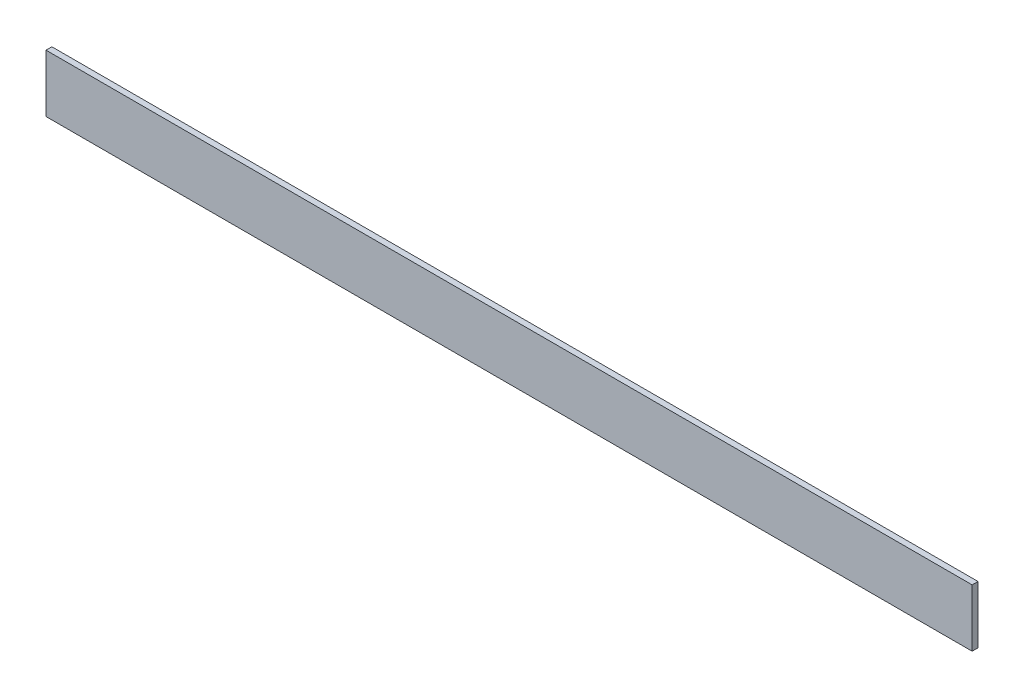
ISO-10303-21;
HEADER;
FILE_DESCRIPTION(('STEP AP214'),'2;1');
FILE_NAME('part.step','',(''),(''),'','','');
FILE_SCHEMA(('AUTOMOTIVE_DESIGN { 1 0 10303 214 1 1 1 1 }'));
ENDSEC;
DATA;
#1=APPLICATION_CONTEXT('core data for automotive mechanical design processes');
#2=APPLICATION_PROTOCOL_DEFINITION('international standard','automotive_design',2000,#1);
#3=PRODUCT_CONTEXT('',#1,'mechanical');
#4=PRODUCT('Part','Part','',(#3));
#5=PRODUCT_RELATED_PRODUCT_CATEGORY('part','',(#4));
#6=PRODUCT_DEFINITION_FORMATION('','',#4);
#7=PRODUCT_DEFINITION_CONTEXT('part definition',#1,'design');
#8=PRODUCT_DEFINITION('design','',#6,#7);
#9=PRODUCT_DEFINITION_SHAPE('','',#8);
#10=(LENGTH_UNIT() NAMED_UNIT(*) SI_UNIT(.MILLI.,.METRE.));
#11=(NAMED_UNIT(*) PLANE_ANGLE_UNIT() SI_UNIT($,.RADIAN.));
#12=(NAMED_UNIT(*) SI_UNIT($,.STERADIAN.) SOLID_ANGLE_UNIT());
#13=UNCERTAINTY_MEASURE_WITH_UNIT(LENGTH_MEASURE(1.E-05),#10,'distance_accuracy_value','');
#14=(GEOMETRIC_REPRESENTATION_CONTEXT(3) GLOBAL_UNCERTAINTY_ASSIGNED_CONTEXT((#13)) GLOBAL_UNIT_ASSIGNED_CONTEXT((#10,
#11,#12)) REPRESENTATION_CONTEXT('',''));
#15=CARTESIAN_POINT('',(0.,0.,0.));
#16=DIRECTION('',(0.,0.,1.));
#17=DIRECTION('',(1.,0.,0.));
#18=AXIS2_PLACEMENT_3D('',#15,#16,#17);
#19=CARTESIAN_POINT('',(236.665,14.69,3.));
#20=DIRECTION('',(-1.,0.,0.));
#21=DIRECTION('',(0.,0.,1.));
#22=AXIS2_PLACEMENT_3D('',#19,#20,#21);
#23=PLANE('',#22);
#24=DIRECTION('',(0.,1.,0.));
#25=VECTOR('',#24,1.);
#26=CARTESIAN_POINT('',(236.665,14.69,0.));
#27=LINE('',#26,#25);
#28=CARTESIAN_POINT('',(236.665,-14.69,0.));
#29=VERTEX_POINT('',#28);
#30=CARTESIAN_POINT('',(236.665,14.69,0.));
#31=VERTEX_POINT('',#30);
#32=EDGE_CURVE('E102',#29,#31,#27,.T.);
#33=ORIENTED_EDGE('',*,*,#32,.T.);
#34=DIRECTION('',(0.,0.,-1.));
#35=VECTOR('',#34,1.);
#36=CARTESIAN_POINT('',(236.665,14.69,3.));
#37=LINE('',#36,#35);
#38=CARTESIAN_POINT('',(236.665,14.69,3.));
#39=VERTEX_POINT('',#38);
#40=EDGE_CURVE('E11',#39,#31,#37,.T.);
#41=ORIENTED_EDGE('',*,*,#40,.F.);
#42=DIRECTION('',(0.,1.,0.));
#43=VECTOR('',#42,1.);
#44=CARTESIAN_POINT('',(236.665,14.69,3.));
#45=LINE('',#44,#43);
#46=CARTESIAN_POINT('',(236.665,-14.69,3.));
#47=VERTEX_POINT('',#46);
#48=EDGE_CURVE('E90',#47,#39,#45,.T.);
#49=ORIENTED_EDGE('',*,*,#48,.F.);
#50=DIRECTION('',(0.,0.,-1.));
#51=VECTOR('',#50,1.);
#52=CARTESIAN_POINT('',(236.665,-14.69,3.));
#53=LINE('',#52,#51);
#54=EDGE_CURVE('E98',#47,#29,#53,.T.);
#55=ORIENTED_EDGE('',*,*,#54,.T.);
#56=EDGE_LOOP('',(#33,#41,#49,#55));
#57=FACE_BOUND('',#56,.T.);
#58=ADVANCED_FACE('F39',(#57),#23,.F.);
#59=CARTESIAN_POINT('',(-236.665,14.69,3.));
#60=DIRECTION('',(0.,-1.,0.));
#61=DIRECTION('',(0.,0.,-1.));
#62=AXIS2_PLACEMENT_3D('',#59,#60,#61);
#63=PLANE('',#62);
#64=DIRECTION('',(-1.,0.,0.));
#65=VECTOR('',#64,1.);
#66=CARTESIAN_POINT('',(-236.665,14.69,0.));
#67=LINE('',#66,#65);
#68=CARTESIAN_POINT('',(-236.665,14.69,0.));
#69=VERTEX_POINT('',#68);
#70=EDGE_CURVE('E94',#31,#69,#67,.T.);
#71=ORIENTED_EDGE('',*,*,#70,.T.);
#72=DIRECTION('',(0.,0.,-1.));
#73=VECTOR('',#72,1.);
#74=CARTESIAN_POINT('',(-236.665,14.69,3.));
#75=LINE('',#74,#73);
#76=CARTESIAN_POINT('',(-236.665,14.69,3.));
#77=VERTEX_POINT('',#76);
#78=EDGE_CURVE('E47',#77,#69,#75,.T.);
#79=ORIENTED_EDGE('',*,*,#78,.F.);
#80=DIRECTION('',(-1.,0.,0.));
#81=VECTOR('',#80,1.);
#82=CARTESIAN_POINT('',(-236.665,14.69,3.));
#83=LINE('',#82,#81);
#84=EDGE_CURVE('E85',#39,#77,#83,.T.);
#85=ORIENTED_EDGE('',*,*,#84,.F.);
#86=ORIENTED_EDGE('',*,*,#40,.T.);
#87=EDGE_LOOP('',(#71,#79,#85,#86));
#88=FACE_BOUND('',#87,.T.);
#89=ADVANCED_FACE('F93',(#88),#63,.F.);
#90=CARTESIAN_POINT('',(-236.665,14.69,3.));
#91=DIRECTION('',(1.,0.,0.));
#92=DIRECTION('',(0.,0.,-1.));
#93=AXIS2_PLACEMENT_3D('',#90,#91,#92);
#94=PLANE('',#93);
#95=DIRECTION('',(0.,-1.,0.));
#96=VECTOR('',#95,1.);
#97=CARTESIAN_POINT('',(-236.665,14.69,0.));
#98=LINE('',#97,#96);
#99=CARTESIAN_POINT('',(-236.665,-14.69,0.));
#100=VERTEX_POINT('',#99);
#101=EDGE_CURVE('E72',#69,#100,#98,.T.);
#102=ORIENTED_EDGE('',*,*,#101,.T.);
#103=DIRECTION('',(0.,0.,-1.));
#104=VECTOR('',#103,1.);
#105=CARTESIAN_POINT('',(-236.665,-14.69,3.));
#106=LINE('',#105,#104);
#107=CARTESIAN_POINT('',(-236.665,-14.69,3.));
#108=VERTEX_POINT('',#107);
#109=EDGE_CURVE('E95',#108,#100,#106,.T.);
#110=ORIENTED_EDGE('',*,*,#109,.F.);
#111=DIRECTION('',(0.,-1.,0.));
#112=VECTOR('',#111,1.);
#113=CARTESIAN_POINT('',(-236.665,14.69,3.));
#114=LINE('',#113,#112);
#115=EDGE_CURVE('E88',#77,#108,#114,.T.);
#116=ORIENTED_EDGE('',*,*,#115,.F.);
#117=ORIENTED_EDGE('',*,*,#78,.T.);
#118=EDGE_LOOP('',(#102,#110,#116,#117));
#119=FACE_BOUND('',#118,.T.);
#120=ADVANCED_FACE('F96',(#119),#94,.F.);
#121=CARTESIAN_POINT('',(-236.665,-14.69,3.));
#122=DIRECTION('',(0.,1.,0.));
#123=DIRECTION('',(0.,0.,1.));
#124=AXIS2_PLACEMENT_3D('',#121,#122,#123);
#125=PLANE('',#124);
#126=DIRECTION('',(1.,0.,0.));
#127=VECTOR('',#126,1.);
#128=CARTESIAN_POINT('',(-236.665,-14.69,0.));
#129=LINE('',#128,#127);
#130=EDGE_CURVE('E78',#100,#29,#129,.T.);
#131=ORIENTED_EDGE('',*,*,#130,.T.);
#132=ORIENTED_EDGE('',*,*,#54,.F.);
#133=DIRECTION('',(1.,0.,0.));
#134=VECTOR('',#133,1.);
#135=CARTESIAN_POINT('',(-236.665,-14.69,3.));
#136=LINE('',#135,#134);
#137=EDGE_CURVE('E55',#108,#47,#136,.T.);
#138=ORIENTED_EDGE('',*,*,#137,.F.);
#139=ORIENTED_EDGE('',*,*,#109,.T.);
#140=EDGE_LOOP('',(#131,#132,#138,#139));
#141=FACE_BOUND('',#140,.T.);
#142=ADVANCED_FACE('F109',(#141),#125,.F.);
#143=CARTESIAN_POINT('',(0.,0.,3.));
#144=DIRECTION('',(0.,0.,1.));
#145=DIRECTION('',(1.,0.,0.));
#146=AXIS2_PLACEMENT_3D('',#143,#144,#145);
#147=PLANE('',#146);
#148=ORIENTED_EDGE('',*,*,#48,.T.);
#149=ORIENTED_EDGE('',*,*,#84,.T.);
#150=ORIENTED_EDGE('',*,*,#115,.T.);
#151=ORIENTED_EDGE('',*,*,#137,.T.);
#152=EDGE_LOOP('',(#148,#149,#150,#151));
#153=FACE_BOUND('',#152,.T.);
#154=ADVANCED_FACE('F86',(#153),#147,.T.);
#155=CARTESIAN_POINT('',(0.,0.,0.));
#156=DIRECTION('',(0.,0.,1.));
#157=DIRECTION('',(1.,0.,0.));
#158=AXIS2_PLACEMENT_3D('',#155,#156,#157);
#159=PLANE('',#158);
#160=ORIENTED_EDGE('',*,*,#32,.F.);
#161=ORIENTED_EDGE('',*,*,#130,.F.);
#162=ORIENTED_EDGE('',*,*,#101,.F.);
#163=ORIENTED_EDGE('',*,*,#70,.F.);
#164=EDGE_LOOP('',(#160,#161,#162,#163));
#165=FACE_BOUND('',#164,.T.);
#166=ADVANCED_FACE('F112',(#165),#159,.F.);
#167=CLOSED_SHELL('',(#58,#89,#120,#142,#154,#166));
#168=MANIFOLD_SOLID_BREP('B2',#167);
#169=ADVANCED_BREP_SHAPE_REPRESENTATION('',(#18,#168),#14);
#170=SHAPE_DEFINITION_REPRESENTATION(#9,#169);
ENDSEC;
END-ISO-10303-21;
